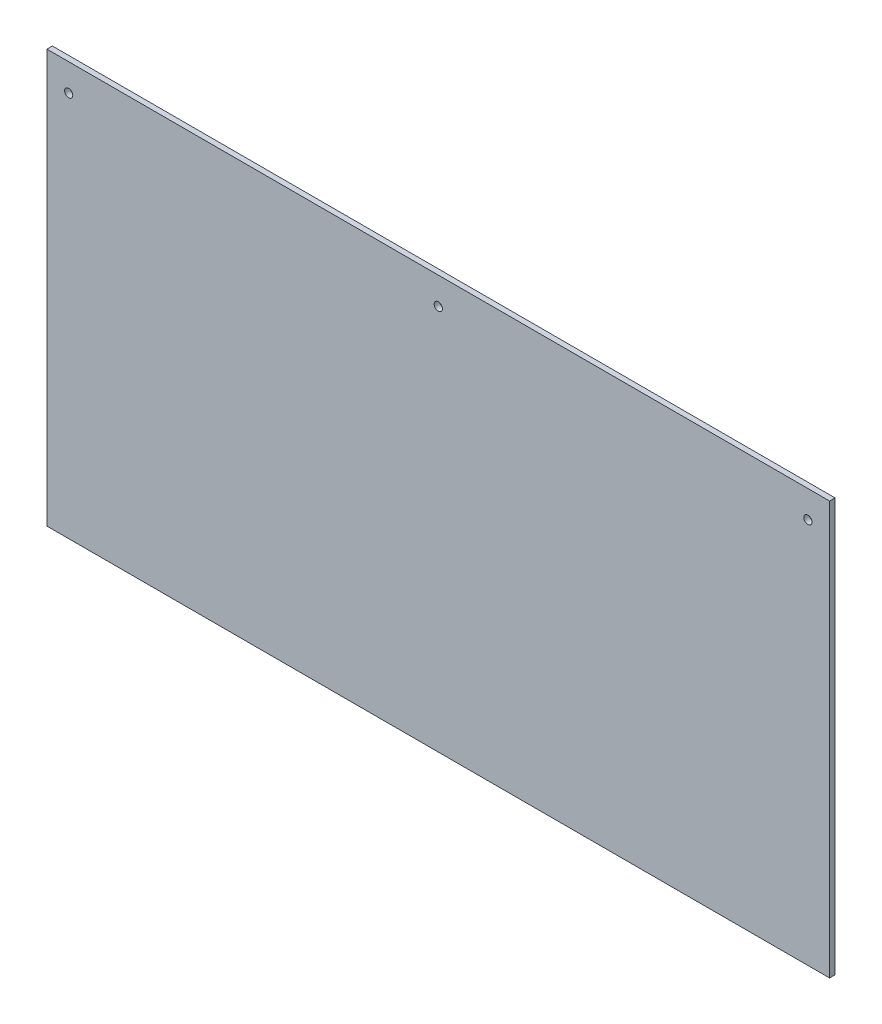
ISO-10303-21;
HEADER;
FILE_DESCRIPTION(('STEP AP214'),'2;1');
FILE_NAME('part.step','',(''),(''),'','','');
FILE_SCHEMA(('AUTOMOTIVE_DESIGN { 1 0 10303 214 1 1 1 1 }'));
ENDSEC;
DATA;
#1=APPLICATION_CONTEXT('core data for automotive mechanical design processes');
#2=APPLICATION_PROTOCOL_DEFINITION('international standard','automotive_design',2000,#1);
#3=PRODUCT_CONTEXT('',#1,'mechanical');
#4=PRODUCT('Part','Part','',(#3));
#5=PRODUCT_RELATED_PRODUCT_CATEGORY('part','',(#4));
#6=PRODUCT_DEFINITION_FORMATION('','',#4);
#7=PRODUCT_DEFINITION_CONTEXT('part definition',#1,'design');
#8=PRODUCT_DEFINITION('design','',#6,#7);
#9=PRODUCT_DEFINITION_SHAPE('','',#8);
#10=(LENGTH_UNIT() NAMED_UNIT(*) SI_UNIT(.MILLI.,.METRE.));
#11=(NAMED_UNIT(*) PLANE_ANGLE_UNIT() SI_UNIT($,.RADIAN.));
#12=(NAMED_UNIT(*) SI_UNIT($,.STERADIAN.) SOLID_ANGLE_UNIT());
#13=UNCERTAINTY_MEASURE_WITH_UNIT(LENGTH_MEASURE(1.E-05),#10,'distance_accuracy_value','');
#14=(GEOMETRIC_REPRESENTATION_CONTEXT(3) GLOBAL_UNCERTAINTY_ASSIGNED_CONTEXT((#13)) GLOBAL_UNIT_ASSIGNED_CONTEXT((#10,
#11,#12)) REPRESENTATION_CONTEXT('',''));
#15=CARTESIAN_POINT('',(0.,0.,0.));
#16=DIRECTION('',(0.,0.,1.));
#17=DIRECTION('',(1.,0.,0.));
#18=AXIS2_PLACEMENT_3D('',#15,#16,#17);
#19=CARTESIAN_POINT('',(412.607970303941,241.3,6.35));
#20=DIRECTION('',(0.,0.,1.));
#21=DIRECTION('',(1.,0.,0.));
#22=AXIS2_PLACEMENT_3D('',#19,#20,#21);
#23=PLANE('',#22);
#24=CARTESIAN_POINT('',(-19.1920296960583,450.85,6.35));
#25=DIRECTION('',(0.,0.,1.));
#26=DIRECTION('',(1.,0.,0.));
#27=AXIS2_PLACEMENT_3D('',#24,#25,#26);
#28=CIRCLE('',#27,4.7625);
#29=CARTESIAN_POINT('',(-14.4295296960583,450.85,6.35));
#30=VERTEX_POINT('',#29);
#31=EDGE_CURVE('E89',#30,#30,#28,.F.);
#32=ORIENTED_EDGE('',*,*,#31,.T.);
#33=EDGE_LOOP('',(#32));
#34=FACE_BOUND('',#33,.T.);
#35=CARTESIAN_POINT('',(844.407970303943,450.85,6.35));
#36=DIRECTION('',(0.,0.,1.));
#37=DIRECTION('',(1.,0.,0.));
#38=AXIS2_PLACEMENT_3D('',#35,#36,#37);
#39=CIRCLE('',#38,4.7625);
#40=CARTESIAN_POINT('',(849.170470303943,450.85,6.35));
#41=VERTEX_POINT('',#40);
#42=EDGE_CURVE('E91',#41,#41,#39,.F.);
#43=ORIENTED_EDGE('',*,*,#42,.T.);
#44=EDGE_LOOP('',(#43));
#45=FACE_BOUND('',#44,.T.);
#46=CARTESIAN_POINT('',(412.607970303941,450.85,6.35));
#47=DIRECTION('',(0.,0.,1.));
#48=DIRECTION('',(1.,0.,0.));
#49=AXIS2_PLACEMENT_3D('',#46,#47,#48);
#50=CIRCLE('',#49,4.7625);
#51=CARTESIAN_POINT('',(417.370470303941,450.85,6.35));
#52=VERTEX_POINT('',#51);
#53=EDGE_CURVE('E20',#52,#52,#50,.F.);
#54=ORIENTED_EDGE('',*,*,#53,.T.);
#55=EDGE_LOOP('',(#54));
#56=FACE_BOUND('',#55,.T.);
#57=DIRECTION('',(0.,1.,0.));
#58=VECTOR('',#57,1.);
#59=CARTESIAN_POINT('',(-44.5920296960584,0.,6.35));
#60=LINE('',#59,#58);
#61=CARTESIAN_POINT('',(-44.5920296960584,0.,6.35));
#62=VERTEX_POINT('',#61);
#63=CARTESIAN_POINT('',(-44.5920296960584,482.6,6.35));
#64=VERTEX_POINT('',#63);
#65=EDGE_CURVE('E71',#62,#64,#60,.T.);
#66=ORIENTED_EDGE('',*,*,#65,.F.);
#67=DIRECTION('',(1.,0.,0.));
#68=VECTOR('',#67,1.);
#69=CARTESIAN_POINT('',(869.807970303941,0.,6.35));
#70=LINE('',#69,#68);
#71=CARTESIAN_POINT('',(869.807970303941,0.,6.35));
#72=VERTEX_POINT('',#71);
#73=EDGE_CURVE('E68',#72,#62,#70,.F.);
#74=ORIENTED_EDGE('',*,*,#73,.F.);
#75=DIRECTION('',(0.,1.,0.));
#76=VECTOR('',#75,1.);
#77=CARTESIAN_POINT('',(869.807970303941,482.6,6.35));
#78=LINE('',#77,#76);
#79=CARTESIAN_POINT('',(869.807970303941,482.6,6.35));
#80=VERTEX_POINT('',#79);
#81=EDGE_CURVE('E59',#80,#72,#78,.F.);
#82=ORIENTED_EDGE('',*,*,#81,.F.);
#83=DIRECTION('',(1.,0.,0.));
#84=VECTOR('',#83,1.);
#85=CARTESIAN_POINT('',(-44.5920296960584,482.6,6.35));
#86=LINE('',#85,#84);
#87=EDGE_CURVE('E54',#64,#80,#86,.T.);
#88=ORIENTED_EDGE('',*,*,#87,.F.);
#89=EDGE_LOOP('',(#66,#74,#82,#88));
#90=FACE_BOUND('',#89,.T.);
#91=ADVANCED_FACE('F17',(#34,#45,#56,#90),#23,.T.);
#92=CARTESIAN_POINT('',(869.807970303941,0.,0.));
#93=DIRECTION('',(0.,-1.,0.));
#94=DIRECTION('',(0.,0.,-1.));
#95=AXIS2_PLACEMENT_3D('',#92,#93,#94);
#96=PLANE('',#95);
#97=ORIENTED_EDGE('',*,*,#73,.T.);
#98=DIRECTION('',(0.,0.,1.));
#99=VECTOR('',#98,1.);
#100=CARTESIAN_POINT('',(-44.5920296960584,0.,0.));
#101=LINE('',#100,#99);
#102=CARTESIAN_POINT('',(-44.5920296960584,0.,0.));
#103=VERTEX_POINT('',#102);
#104=EDGE_CURVE('E99',#103,#62,#101,.T.);
#105=ORIENTED_EDGE('',*,*,#104,.F.);
#106=DIRECTION('',(1.,0.,0.));
#107=VECTOR('',#106,1.);
#108=CARTESIAN_POINT('',(412.607970303941,0.,0.));
#109=LINE('',#108,#107);
#110=CARTESIAN_POINT('',(869.807970303941,0.,0.));
#111=VERTEX_POINT('',#110);
#112=EDGE_CURVE('E78',#103,#111,#109,.T.);
#113=ORIENTED_EDGE('',*,*,#112,.T.);
#114=DIRECTION('',(0.,0.,-1.));
#115=VECTOR('',#114,1.);
#116=CARTESIAN_POINT('',(869.807970303941,0.,0.));
#117=LINE('',#116,#115);
#118=EDGE_CURVE('E64',#72,#111,#117,.T.);
#119=ORIENTED_EDGE('',*,*,#118,.F.);
#120=EDGE_LOOP('',(#97,#105,#113,#119));
#121=FACE_BOUND('',#120,.T.);
#122=ADVANCED_FACE('F77',(#121),#96,.T.);
#123=CARTESIAN_POINT('',(869.807970303941,482.6,0.));
#124=DIRECTION('',(1.,0.,0.));
#125=DIRECTION('',(0.,0.,-1.));
#126=AXIS2_PLACEMENT_3D('',#123,#124,#125);
#127=PLANE('',#126);
#128=ORIENTED_EDGE('',*,*,#81,.T.);
#129=ORIENTED_EDGE('',*,*,#118,.T.);
#130=DIRECTION('',(0.,1.,0.));
#131=VECTOR('',#130,1.);
#132=CARTESIAN_POINT('',(869.807970303941,241.3,0.));
#133=LINE('',#132,#131);
#134=CARTESIAN_POINT('',(869.807970303941,482.6,0.));
#135=VERTEX_POINT('',#134);
#136=EDGE_CURVE('E110',#111,#135,#133,.T.);
#137=ORIENTED_EDGE('',*,*,#136,.T.);
#138=DIRECTION('',(0.,0.,1.));
#139=VECTOR('',#138,1.);
#140=CARTESIAN_POINT('',(869.807970303941,482.6,0.));
#141=LINE('',#140,#139);
#142=EDGE_CURVE('E66',#80,#135,#141,.F.);
#143=ORIENTED_EDGE('',*,*,#142,.F.);
#144=EDGE_LOOP('',(#128,#129,#137,#143));
#145=FACE_BOUND('',#144,.T.);
#146=ADVANCED_FACE('F61',(#145),#127,.T.);
#147=CARTESIAN_POINT('',(-44.5920296960584,482.6,0.));
#148=DIRECTION('',(0.,1.,0.));
#149=DIRECTION('',(0.,0.,1.));
#150=AXIS2_PLACEMENT_3D('',#147,#148,#149);
#151=PLANE('',#150);
#152=ORIENTED_EDGE('',*,*,#87,.T.);
#153=ORIENTED_EDGE('',*,*,#142,.T.);
#154=DIRECTION('',(1.,0.,0.));
#155=VECTOR('',#154,1.);
#156=CARTESIAN_POINT('',(412.607970303941,482.6,0.));
#157=LINE('',#156,#155);
#158=CARTESIAN_POINT('',(-44.5920296960584,482.6,0.));
#159=VERTEX_POINT('',#158);
#160=EDGE_CURVE('E107',#135,#159,#157,.F.);
#161=ORIENTED_EDGE('',*,*,#160,.T.);
#162=DIRECTION('',(0.,0.,1.));
#163=VECTOR('',#162,1.);
#164=CARTESIAN_POINT('',(-44.5920296960584,482.6,0.));
#165=LINE('',#164,#163);
#166=EDGE_CURVE('E35',#64,#159,#165,.F.);
#167=ORIENTED_EDGE('',*,*,#166,.F.);
#168=EDGE_LOOP('',(#152,#153,#161,#167));
#169=FACE_BOUND('',#168,.T.);
#170=ADVANCED_FACE('F106',(#169),#151,.T.);
#171=CARTESIAN_POINT('',(-44.5920296960584,0.,0.));
#172=DIRECTION('',(-1.,0.,0.));
#173=DIRECTION('',(0.,0.,1.));
#174=AXIS2_PLACEMENT_3D('',#171,#172,#173);
#175=PLANE('',#174);
#176=ORIENTED_EDGE('',*,*,#65,.T.);
#177=ORIENTED_EDGE('',*,*,#166,.T.);
#178=DIRECTION('',(0.,1.,0.));
#179=VECTOR('',#178,1.);
#180=CARTESIAN_POINT('',(-44.5920296960584,241.3,0.));
#181=LINE('',#180,#179);
#182=EDGE_CURVE('E88',#159,#103,#181,.F.);
#183=ORIENTED_EDGE('',*,*,#182,.T.);
#184=ORIENTED_EDGE('',*,*,#104,.T.);
#185=EDGE_LOOP('',(#176,#177,#183,#184));
#186=FACE_BOUND('',#185,.T.);
#187=ADVANCED_FACE('F113',(#186),#175,.T.);
#188=CARTESIAN_POINT('',(412.607970303941,450.85,0.));
#189=DIRECTION('',(0.,0.,1.));
#190=DIRECTION('',(1.,0.,0.));
#191=AXIS2_PLACEMENT_3D('',#188,#189,#190);
#192=CYLINDRICAL_SURFACE('',#191,4.7625);
#193=ORIENTED_EDGE('',*,*,#53,.F.);
#194=EDGE_LOOP('',(#193));
#195=FACE_BOUND('',#194,.T.);
#196=CARTESIAN_POINT('',(412.607970303941,450.85,0.));
#197=DIRECTION('',(0.,0.,1.));
#198=DIRECTION('',(1.,0.,0.));
#199=AXIS2_PLACEMENT_3D('',#196,#197,#198);
#200=CIRCLE('',#199,4.7625);
#201=CARTESIAN_POINT('',(417.370470303941,450.85,0.));
#202=VERTEX_POINT('',#201);
#203=EDGE_CURVE('E85',#202,#202,#200,.F.);
#204=ORIENTED_EDGE('',*,*,#203,.T.);
#205=EDGE_LOOP('',(#204));
#206=FACE_BOUND('',#205,.T.);
#207=ADVANCED_FACE('F115',(#195,#206),#192,.F.);
#208=CARTESIAN_POINT('',(844.407970303943,450.85,0.));
#209=DIRECTION('',(0.,0.,1.));
#210=DIRECTION('',(1.,0.,0.));
#211=AXIS2_PLACEMENT_3D('',#208,#209,#210);
#212=CYLINDRICAL_SURFACE('',#211,4.7625);
#213=ORIENTED_EDGE('',*,*,#42,.F.);
#214=EDGE_LOOP('',(#213));
#215=FACE_BOUND('',#214,.T.);
#216=CARTESIAN_POINT('',(844.407970303943,450.85,0.));
#217=DIRECTION('',(0.,0.,1.));
#218=DIRECTION('',(1.,0.,0.));
#219=AXIS2_PLACEMENT_3D('',#216,#217,#218);
#220=CIRCLE('',#219,4.7625);
#221=CARTESIAN_POINT('',(849.170470303943,450.85,0.));
#222=VERTEX_POINT('',#221);
#223=EDGE_CURVE('E26',#222,#222,#220,.F.);
#224=ORIENTED_EDGE('',*,*,#223,.T.);
#225=EDGE_LOOP('',(#224));
#226=FACE_BOUND('',#225,.T.);
#227=ADVANCED_FACE('F122',(#215,#226),#212,.F.);
#228=CARTESIAN_POINT('',(-19.1920296960583,450.85,0.));
#229=DIRECTION('',(0.,0.,1.));
#230=DIRECTION('',(1.,0.,0.));
#231=AXIS2_PLACEMENT_3D('',#228,#229,#230);
#232=CYLINDRICAL_SURFACE('',#231,4.7625);
#233=ORIENTED_EDGE('',*,*,#31,.F.);
#234=EDGE_LOOP('',(#233));
#235=FACE_BOUND('',#234,.T.);
#236=CARTESIAN_POINT('',(-19.1920296960583,450.85,0.));
#237=DIRECTION('',(0.,0.,1.));
#238=DIRECTION('',(1.,0.,0.));
#239=AXIS2_PLACEMENT_3D('',#236,#237,#238);
#240=CIRCLE('',#239,4.7625);
#241=CARTESIAN_POINT('',(-14.4295296960583,450.85,0.));
#242=VERTEX_POINT('',#241);
#243=EDGE_CURVE('E11',#242,#242,#240,.F.);
#244=ORIENTED_EDGE('',*,*,#243,.T.);
#245=EDGE_LOOP('',(#244));
#246=FACE_BOUND('',#245,.T.);
#247=ADVANCED_FACE('F127',(#235,#246),#232,.F.);
#248=CARTESIAN_POINT('',(412.607970303941,241.3,0.));
#249=DIRECTION('',(0.,0.,1.));
#250=DIRECTION('',(1.,0.,0.));
#251=AXIS2_PLACEMENT_3D('',#248,#249,#250);
#252=PLANE('',#251);
#253=ORIENTED_EDGE('',*,*,#243,.F.);
#254=EDGE_LOOP('',(#253));
#255=FACE_BOUND('',#254,.T.);
#256=ORIENTED_EDGE('',*,*,#223,.F.);
#257=EDGE_LOOP('',(#256));
#258=FACE_BOUND('',#257,.T.);
#259=ORIENTED_EDGE('',*,*,#203,.F.);
#260=EDGE_LOOP('',(#259));
#261=FACE_BOUND('',#260,.T.);
#262=ORIENTED_EDGE('',*,*,#160,.F.);
#263=ORIENTED_EDGE('',*,*,#136,.F.);
#264=ORIENTED_EDGE('',*,*,#112,.F.);
#265=ORIENTED_EDGE('',*,*,#182,.F.);
#266=EDGE_LOOP('',(#262,#263,#264,#265));
#267=FACE_BOUND('',#266,.T.);
#268=ADVANCED_FACE('F109',(#255,#258,#261,#267),#252,.F.);
#269=CLOSED_SHELL('',(#91,#122,#146,#170,#187,#207,#227,#247,#268));
#270=MANIFOLD_SOLID_BREP('B1',#269);
#271=ADVANCED_BREP_SHAPE_REPRESENTATION('',(#18,#270),#14);
#272=SHAPE_DEFINITION_REPRESENTATION(#9,#271);
ENDSEC;
END-ISO-10303-21;
